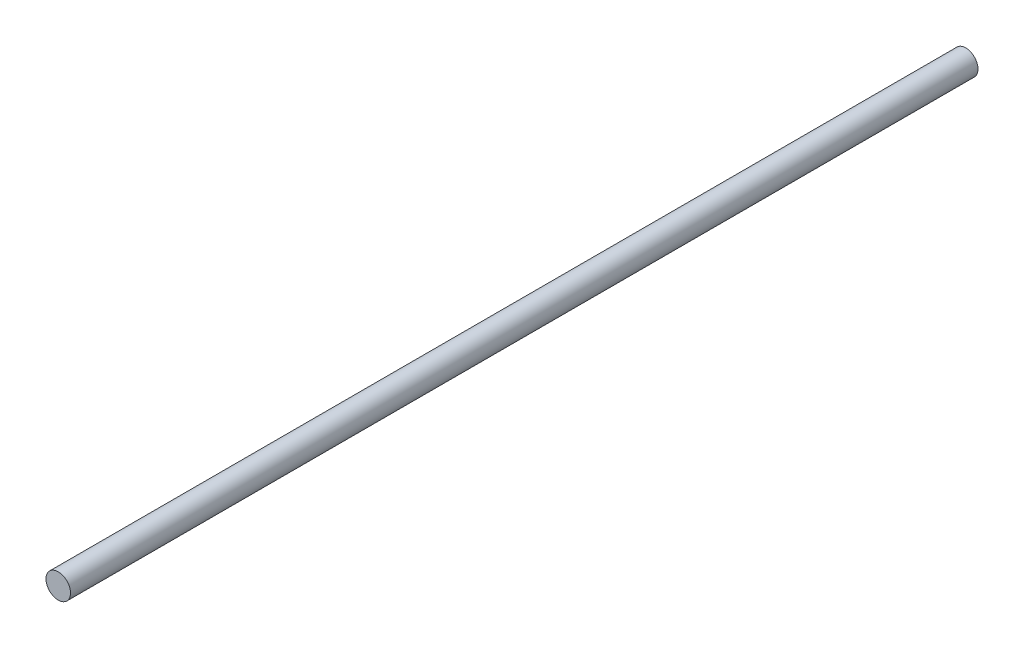
ISO-10303-21;
HEADER;
FILE_DESCRIPTION(('STEP AP214'),'2;1');
FILE_NAME('part.step','',(''),(''),'','','');
FILE_SCHEMA(('AUTOMOTIVE_DESIGN { 1 0 10303 214 1 1 1 1 }'));
ENDSEC;
DATA;
#1=APPLICATION_CONTEXT('core data for automotive mechanical design processes');
#2=APPLICATION_PROTOCOL_DEFINITION('international standard','automotive_design',2000,#1);
#3=PRODUCT_CONTEXT('',#1,'mechanical');
#4=PRODUCT('Part','Part','',(#3));
#5=PRODUCT_RELATED_PRODUCT_CATEGORY('part','',(#4));
#6=PRODUCT_DEFINITION_FORMATION('','',#4);
#7=PRODUCT_DEFINITION_CONTEXT('part definition',#1,'design');
#8=PRODUCT_DEFINITION('design','',#6,#7);
#9=PRODUCT_DEFINITION_SHAPE('','',#8);
#10=(LENGTH_UNIT() NAMED_UNIT(*) SI_UNIT(.MILLI.,.METRE.));
#11=(NAMED_UNIT(*) PLANE_ANGLE_UNIT() SI_UNIT($,.RADIAN.));
#12=(NAMED_UNIT(*) SI_UNIT($,.STERADIAN.) SOLID_ANGLE_UNIT());
#13=UNCERTAINTY_MEASURE_WITH_UNIT(LENGTH_MEASURE(1.E-05),#10,'distance_accuracy_value','');
#14=(GEOMETRIC_REPRESENTATION_CONTEXT(3) GLOBAL_UNCERTAINTY_ASSIGNED_CONTEXT((#13)) GLOBAL_UNIT_ASSIGNED_CONTEXT((#10,
#11,#12)) REPRESENTATION_CONTEXT('',''));
#15=CARTESIAN_POINT('',(0.,0.,0.));
#16=DIRECTION('',(0.,0.,1.));
#17=DIRECTION('',(1.,0.,0.));
#18=AXIS2_PLACEMENT_3D('',#15,#16,#17);
#19=CARTESIAN_POINT('',(0.,0.,17.9));
#20=DIRECTION('',(0.,0.,-1.));
#21=DIRECTION('',(-1.,0.,0.));
#22=AXIS2_PLACEMENT_3D('',#19,#20,#21);
#23=PLANE('',#22);
#24=CARTESIAN_POINT('',(0.,0.,17.9));
#25=DIRECTION('',(0.,0.,1.));
#26=DIRECTION('',(1.,0.,0.));
#27=AXIS2_PLACEMENT_3D('',#24,#25,#26);
#28=CIRCLE('',#27,4.);
#29=CARTESIAN_POINT('',(4.,0.,17.9));
#30=VERTEX_POINT('',#29);
#31=EDGE_CURVE('E10',#30,#30,#28,.T.);
#32=ORIENTED_EDGE('',*,*,#31,.T.);
#33=EDGE_LOOP('',(#32));
#34=FACE_BOUND('',#33,.T.);
#35=ADVANCED_FACE('F35',(#34),#23,.F.);
#36=CARTESIAN_POINT('',(0.,0.,17.9));
#37=DIRECTION('',(0.,0.,1.));
#38=DIRECTION('',(1.,0.,0.));
#39=AXIS2_PLACEMENT_3D('',#36,#37,#38);
#40=CYLINDRICAL_SURFACE('',#39,4.);
#41=ORIENTED_EDGE('',*,*,#31,.F.);
#42=EDGE_LOOP('',(#41));
#43=FACE_BOUND('',#42,.T.);
#44=CARTESIAN_POINT('',(0.,0.,-277.9));
#45=DIRECTION('',(0.,0.,1.));
#46=DIRECTION('',(1.,0.,0.));
#47=AXIS2_PLACEMENT_3D('',#44,#45,#46);
#48=CIRCLE('',#47,4.);
#49=CARTESIAN_POINT('',(4.,0.,-277.9));
#50=VERTEX_POINT('',#49);
#51=EDGE_CURVE('E41',#50,#50,#48,.T.);
#52=ORIENTED_EDGE('',*,*,#51,.T.);
#53=EDGE_LOOP('',(#52));
#54=FACE_BOUND('',#53,.T.);
#55=ADVANCED_FACE('F47',(#43,#54),#40,.T.);
#56=CARTESIAN_POINT('',(0.,0.,-277.9));
#57=DIRECTION('',(0.,0.,1.));
#58=DIRECTION('',(1.,0.,0.));
#59=AXIS2_PLACEMENT_3D('',#56,#57,#58);
#60=PLANE('',#59);
#61=ORIENTED_EDGE('',*,*,#51,.F.);
#62=EDGE_LOOP('',(#61));
#63=FACE_BOUND('',#62,.T.);
#64=ADVANCED_FACE('F49',(#63),#60,.F.);
#65=CLOSED_SHELL('',(#35,#55,#64));
#66=MANIFOLD_SOLID_BREP('B2',#65);
#67=ADVANCED_BREP_SHAPE_REPRESENTATION('',(#18,#66),#14);
#68=SHAPE_DEFINITION_REPRESENTATION(#9,#67);
ENDSEC;
END-ISO-10303-21;
